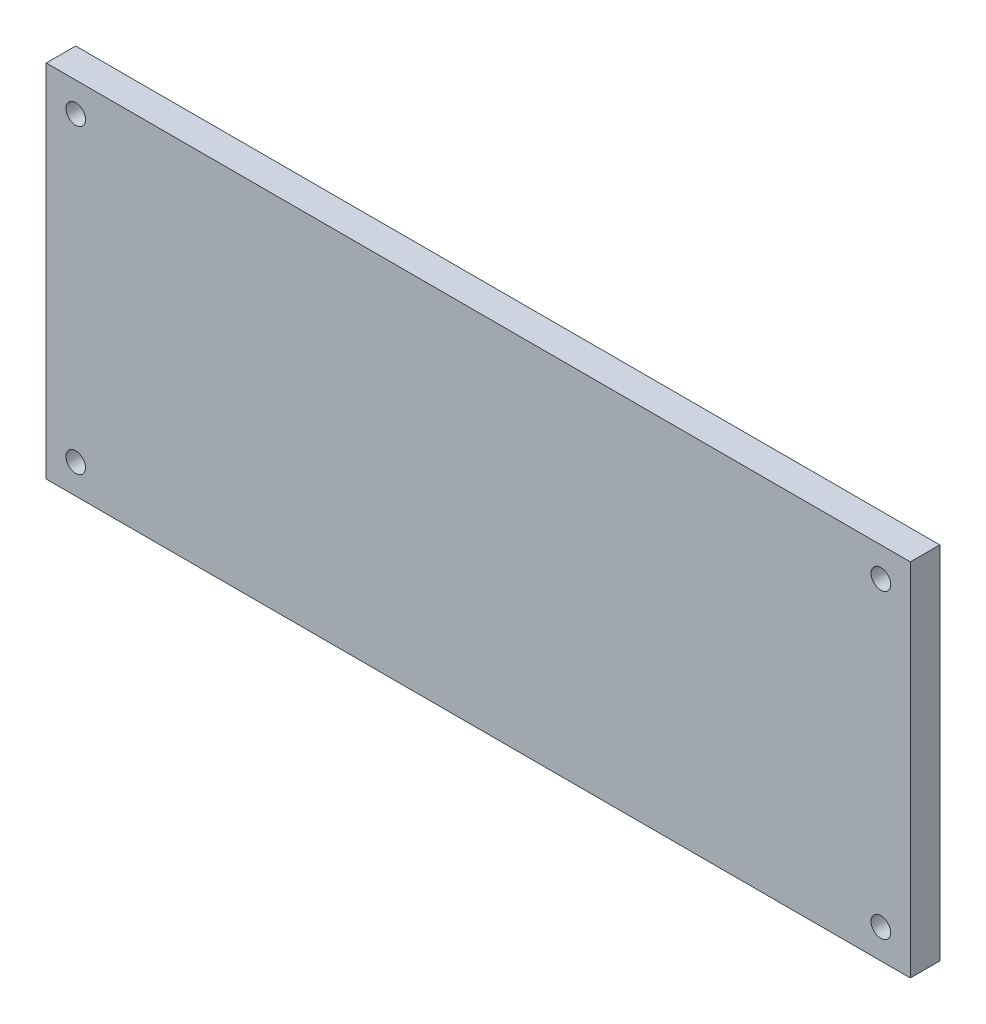
ISO-10303-21;
HEADER;
FILE_DESCRIPTION(('STEP AP214'),'2;1');
FILE_NAME('part.step','',(''),(''),'','','');
FILE_SCHEMA(('AUTOMOTIVE_DESIGN { 1 0 10303 214 1 1 1 1 }'));
ENDSEC;
DATA;
#1=APPLICATION_CONTEXT('core data for automotive mechanical design processes');
#2=APPLICATION_PROTOCOL_DEFINITION('international standard','automotive_design',2000,#1);
#3=PRODUCT_CONTEXT('',#1,'mechanical');
#4=PRODUCT('Part','Part','',(#3));
#5=PRODUCT_RELATED_PRODUCT_CATEGORY('part','',(#4));
#6=PRODUCT_DEFINITION_FORMATION('','',#4);
#7=PRODUCT_DEFINITION_CONTEXT('part definition',#1,'design');
#8=PRODUCT_DEFINITION('design','',#6,#7);
#9=PRODUCT_DEFINITION_SHAPE('','',#8);
#10=(LENGTH_UNIT() NAMED_UNIT(*) SI_UNIT(.MILLI.,.METRE.));
#11=(NAMED_UNIT(*) PLANE_ANGLE_UNIT() SI_UNIT($,.RADIAN.));
#12=(NAMED_UNIT(*) SI_UNIT($,.STERADIAN.) SOLID_ANGLE_UNIT());
#13=UNCERTAINTY_MEASURE_WITH_UNIT(LENGTH_MEASURE(1.E-05),#10,'distance_accuracy_value','');
#14=(GEOMETRIC_REPRESENTATION_CONTEXT(3) GLOBAL_UNCERTAINTY_ASSIGNED_CONTEXT((#13)) GLOBAL_UNIT_ASSIGNED_CONTEXT((#10,
#11,#12)) REPRESENTATION_CONTEXT('',''));
#15=CARTESIAN_POINT('',(0.,0.,0.));
#16=DIRECTION('',(0.,0.,1.));
#17=DIRECTION('',(1.,0.,0.));
#18=AXIS2_PLACEMENT_3D('',#15,#16,#17);
#19=CARTESIAN_POINT('',(0.,0.,1.5));
#20=DIRECTION('',(0.,0.,-1.));
#21=DIRECTION('',(-1.,0.,0.));
#22=AXIS2_PLACEMENT_3D('',#19,#20,#21);
#23=PLANE('',#22);
#24=DIRECTION('',(0.,-1.,0.));
#25=VECTOR('',#24,1.);
#26=CARTESIAN_POINT('',(0.,0.,1.5));
#27=LINE('',#26,#25);
#28=CARTESIAN_POINT('',(0.,18.35,1.5));
#29=VERTEX_POINT('',#28);
#30=CARTESIAN_POINT('',(0.,0.,1.5));
#31=VERTEX_POINT('',#30);
#32=EDGE_CURVE('E98',#29,#31,#27,.T.);
#33=ORIENTED_EDGE('',*,*,#32,.T.);
#34=DIRECTION('',(1.,0.,0.));
#35=VECTOR('',#34,1.);
#36=CARTESIAN_POINT('',(0.,0.,1.5));
#37=LINE('',#36,#35);
#38=CARTESIAN_POINT('',(44.,0.,1.5));
#39=VERTEX_POINT('',#38);
#40=EDGE_CURVE('E93',#31,#39,#37,.T.);
#41=ORIENTED_EDGE('',*,*,#40,.T.);
#42=DIRECTION('',(0.,1.,0.));
#43=VECTOR('',#42,1.);
#44=CARTESIAN_POINT('',(44.,0.,1.5));
#45=LINE('',#44,#43);
#46=CARTESIAN_POINT('',(44.,18.35,1.5));
#47=VERTEX_POINT('',#46);
#48=EDGE_CURVE('E96',#39,#47,#45,.T.);
#49=ORIENTED_EDGE('',*,*,#48,.T.);
#50=DIRECTION('',(-1.,0.,0.));
#51=VECTOR('',#50,1.);
#52=CARTESIAN_POINT('',(0.,18.35,1.5));
#53=LINE('',#52,#51);
#54=EDGE_CURVE('E63',#47,#29,#53,.T.);
#55=ORIENTED_EDGE('',*,*,#54,.T.);
#56=EDGE_LOOP('',(#33,#41,#49,#55));
#57=FACE_BOUND('',#56,.T.);
#58=CARTESIAN_POINT('',(1.5,16.85,1.5));
#59=DIRECTION('',(0.,0.,1.));
#60=DIRECTION('',(1.,0.,0.));
#61=AXIS2_PLACEMENT_3D('',#58,#59,#60);
#62=CIRCLE('',#61,0.5);
#63=CARTESIAN_POINT('',(2.,16.85,1.5));
#64=VERTEX_POINT('',#63);
#65=EDGE_CURVE('E118',#64,#64,#62,.T.);
#66=ORIENTED_EDGE('',*,*,#65,.F.);
#67=EDGE_LOOP('',(#66));
#68=FACE_BOUND('',#67,.T.);
#69=CARTESIAN_POINT('',(42.5,16.85,1.5));
#70=DIRECTION('',(0.,0.,1.));
#71=DIRECTION('',(-1.,0.,0.));
#72=AXIS2_PLACEMENT_3D('',#69,#70,#71);
#73=CIRCLE('',#72,0.499999999999999);
#74=CARTESIAN_POINT('',(42.,16.85,1.5));
#75=VERTEX_POINT('',#74);
#76=EDGE_CURVE('E140',#75,#75,#73,.T.);
#77=ORIENTED_EDGE('',*,*,#76,.F.);
#78=EDGE_LOOP('',(#77));
#79=FACE_BOUND('',#78,.T.);
#80=CARTESIAN_POINT('',(42.5,1.5,1.5));
#81=DIRECTION('',(0.,0.,1.));
#82=DIRECTION('',(1.,0.,0.));
#83=AXIS2_PLACEMENT_3D('',#80,#81,#82);
#84=CIRCLE('',#83,0.499999999999999);
#85=CARTESIAN_POINT('',(43.,1.5,1.5));
#86=VERTEX_POINT('',#85);
#87=EDGE_CURVE('E148',#86,#86,#84,.T.);
#88=ORIENTED_EDGE('',*,*,#87,.F.);
#89=EDGE_LOOP('',(#88));
#90=FACE_BOUND('',#89,.T.);
#91=CARTESIAN_POINT('',(1.5,1.5,1.5));
#92=DIRECTION('',(0.,0.,1.));
#93=DIRECTION('',(-1.,0.,0.));
#94=AXIS2_PLACEMENT_3D('',#91,#92,#93);
#95=CIRCLE('',#94,0.5);
#96=CARTESIAN_POINT('',(1.,1.5,1.5));
#97=VERTEX_POINT('',#96);
#98=EDGE_CURVE('E156',#97,#97,#95,.T.);
#99=ORIENTED_EDGE('',*,*,#98,.F.);
#100=EDGE_LOOP('',(#99));
#101=FACE_BOUND('',#100,.T.);
#102=ADVANCED_FACE('F45',(#57,#68,#79,#90,#101),#23,.F.);
#103=CARTESIAN_POINT('',(0.,0.,0.));
#104=DIRECTION('',(0.,0.,-1.));
#105=DIRECTION('',(-1.,0.,0.));
#106=AXIS2_PLACEMENT_3D('',#103,#104,#105);
#107=PLANE('',#106);
#108=CARTESIAN_POINT('',(42.5,1.5,0.));
#109=DIRECTION('',(0.,0.,1.));
#110=DIRECTION('',(1.,0.,0.));
#111=AXIS2_PLACEMENT_3D('',#108,#109,#110);
#112=CIRCLE('',#111,0.499999999999999);
#113=CARTESIAN_POINT('',(43.,1.5,0.));
#114=VERTEX_POINT('',#113);
#115=EDGE_CURVE('E152',#114,#114,#112,.T.);
#116=ORIENTED_EDGE('',*,*,#115,.T.);
#117=EDGE_LOOP('',(#116));
#118=FACE_BOUND('',#117,.T.);
#119=CARTESIAN_POINT('',(1.5,16.85,0.));
#120=DIRECTION('',(0.,0.,1.));
#121=DIRECTION('',(1.,0.,0.));
#122=AXIS2_PLACEMENT_3D('',#119,#120,#121);
#123=CIRCLE('',#122,0.5);
#124=CARTESIAN_POINT('',(2.,16.85,0.));
#125=VERTEX_POINT('',#124);
#126=EDGE_CURVE('E136',#125,#125,#123,.T.);
#127=ORIENTED_EDGE('',*,*,#126,.T.);
#128=EDGE_LOOP('',(#127));
#129=FACE_BOUND('',#128,.T.);
#130=DIRECTION('',(0.,-1.,0.));
#131=VECTOR('',#130,1.);
#132=CARTESIAN_POINT('',(0.,0.,0.));
#133=LINE('',#132,#131);
#134=CARTESIAN_POINT('',(0.,18.35,0.));
#135=VERTEX_POINT('',#134);
#136=CARTESIAN_POINT('',(0.,0.,0.));
#137=VERTEX_POINT('',#136);
#138=EDGE_CURVE('E114',#135,#137,#133,.T.);
#139=ORIENTED_EDGE('',*,*,#138,.F.);
#140=DIRECTION('',(-1.,0.,0.));
#141=VECTOR('',#140,1.);
#142=CARTESIAN_POINT('',(0.,18.35,0.));
#143=LINE('',#142,#141);
#144=CARTESIAN_POINT('',(44.,18.35,0.));
#145=VERTEX_POINT('',#144);
#146=EDGE_CURVE('E86',#145,#135,#143,.T.);
#147=ORIENTED_EDGE('',*,*,#146,.F.);
#148=DIRECTION('',(0.,1.,0.));
#149=VECTOR('',#148,1.);
#150=CARTESIAN_POINT('',(44.,0.,0.));
#151=LINE('',#150,#149);
#152=CARTESIAN_POINT('',(44.,0.,0.));
#153=VERTEX_POINT('',#152);
#154=EDGE_CURVE('E80',#153,#145,#151,.T.);
#155=ORIENTED_EDGE('',*,*,#154,.F.);
#156=DIRECTION('',(1.,0.,0.));
#157=VECTOR('',#156,1.);
#158=CARTESIAN_POINT('',(0.,0.,0.));
#159=LINE('',#158,#157);
#160=EDGE_CURVE('E103',#137,#153,#159,.T.);
#161=ORIENTED_EDGE('',*,*,#160,.F.);
#162=EDGE_LOOP('',(#139,#147,#155,#161));
#163=FACE_BOUND('',#162,.T.);
#164=CARTESIAN_POINT('',(42.5,16.85,0.));
#165=DIRECTION('',(0.,0.,1.));
#166=DIRECTION('',(-1.,0.,0.));
#167=AXIS2_PLACEMENT_3D('',#164,#165,#166);
#168=CIRCLE('',#167,0.499999999999999);
#169=CARTESIAN_POINT('',(42.,16.85,0.));
#170=VERTEX_POINT('',#169);
#171=EDGE_CURVE('E144',#170,#170,#168,.T.);
#172=ORIENTED_EDGE('',*,*,#171,.T.);
#173=EDGE_LOOP('',(#172));
#174=FACE_BOUND('',#173,.T.);
#175=CARTESIAN_POINT('',(1.5,1.5,0.));
#176=DIRECTION('',(0.,0.,1.));
#177=DIRECTION('',(-1.,0.,0.));
#178=AXIS2_PLACEMENT_3D('',#175,#176,#177);
#179=CIRCLE('',#178,0.5);
#180=CARTESIAN_POINT('',(1.,1.5,0.));
#181=VERTEX_POINT('',#180);
#182=EDGE_CURVE('E160',#181,#181,#179,.T.);
#183=ORIENTED_EDGE('',*,*,#182,.T.);
#184=EDGE_LOOP('',(#183));
#185=FACE_BOUND('',#184,.T.);
#186=ADVANCED_FACE('F131',(#118,#129,#163,#174,#185),#107,.T.);
#187=CARTESIAN_POINT('',(0.,0.,1.5));
#188=DIRECTION('',(1.,0.,0.));
#189=DIRECTION('',(0.,0.,-1.));
#190=AXIS2_PLACEMENT_3D('',#187,#188,#189);
#191=PLANE('',#190);
#192=ORIENTED_EDGE('',*,*,#138,.T.);
#193=DIRECTION('',(0.,0.,-1.));
#194=VECTOR('',#193,1.);
#195=CARTESIAN_POINT('',(0.,0.,1.5));
#196=LINE('',#195,#194);
#197=EDGE_CURVE('E11',#31,#137,#196,.T.);
#198=ORIENTED_EDGE('',*,*,#197,.F.);
#199=ORIENTED_EDGE('',*,*,#32,.F.);
#200=DIRECTION('',(0.,0.,-1.));
#201=VECTOR('',#200,1.);
#202=CARTESIAN_POINT('',(0.,18.35,1.5));
#203=LINE('',#202,#201);
#204=EDGE_CURVE('E110',#29,#135,#203,.T.);
#205=ORIENTED_EDGE('',*,*,#204,.T.);
#206=EDGE_LOOP('',(#192,#198,#199,#205));
#207=FACE_BOUND('',#206,.T.);
#208=ADVANCED_FACE('F47',(#207),#191,.F.);
#209=CARTESIAN_POINT('',(0.,0.,1.5));
#210=DIRECTION('',(0.,1.,0.));
#211=DIRECTION('',(0.,0.,1.));
#212=AXIS2_PLACEMENT_3D('',#209,#210,#211);
#213=PLANE('',#212);
#214=ORIENTED_EDGE('',*,*,#160,.T.);
#215=DIRECTION('',(0.,0.,-1.));
#216=VECTOR('',#215,1.);
#217=CARTESIAN_POINT('',(44.,0.,1.5));
#218=LINE('',#217,#216);
#219=EDGE_CURVE('E55',#39,#153,#218,.T.);
#220=ORIENTED_EDGE('',*,*,#219,.F.);
#221=ORIENTED_EDGE('',*,*,#40,.F.);
#222=ORIENTED_EDGE('',*,*,#197,.T.);
#223=EDGE_LOOP('',(#214,#220,#221,#222));
#224=FACE_BOUND('',#223,.T.);
#225=ADVANCED_FACE('F102',(#224),#213,.F.);
#226=CARTESIAN_POINT('',(44.,0.,1.5));
#227=DIRECTION('',(-1.,0.,0.));
#228=DIRECTION('',(0.,0.,1.));
#229=AXIS2_PLACEMENT_3D('',#226,#227,#228);
#230=PLANE('',#229);
#231=ORIENTED_EDGE('',*,*,#154,.T.);
#232=DIRECTION('',(0.,0.,-1.));
#233=VECTOR('',#232,1.);
#234=CARTESIAN_POINT('',(44.,18.35,1.5));
#235=LINE('',#234,#233);
#236=EDGE_CURVE('E105',#47,#145,#235,.T.);
#237=ORIENTED_EDGE('',*,*,#236,.F.);
#238=ORIENTED_EDGE('',*,*,#48,.F.);
#239=ORIENTED_EDGE('',*,*,#219,.T.);
#240=EDGE_LOOP('',(#231,#237,#238,#239));
#241=FACE_BOUND('',#240,.T.);
#242=ADVANCED_FACE('F106',(#241),#230,.F.);
#243=CARTESIAN_POINT('',(0.,18.35,1.5));
#244=DIRECTION('',(0.,-1.,0.));
#245=DIRECTION('',(0.,0.,-1.));
#246=AXIS2_PLACEMENT_3D('',#243,#244,#245);
#247=PLANE('',#246);
#248=ORIENTED_EDGE('',*,*,#146,.T.);
#249=ORIENTED_EDGE('',*,*,#204,.F.);
#250=ORIENTED_EDGE('',*,*,#54,.F.);
#251=ORIENTED_EDGE('',*,*,#236,.T.);
#252=EDGE_LOOP('',(#248,#249,#250,#251));
#253=FACE_BOUND('',#252,.T.);
#254=ADVANCED_FACE('F128',(#253),#247,.F.);
#255=CARTESIAN_POINT('',(1.5,16.85,1.5));
#256=DIRECTION('',(0.,0.,-1.));
#257=DIRECTION('',(-1.,0.,0.));
#258=AXIS2_PLACEMENT_3D('',#255,#256,#257);
#259=CYLINDRICAL_SURFACE('',#258,0.5);
#260=ORIENTED_EDGE('',*,*,#65,.T.);
#261=EDGE_LOOP('',(#260));
#262=FACE_BOUND('',#261,.T.);
#263=ORIENTED_EDGE('',*,*,#126,.F.);
#264=EDGE_LOOP('',(#263));
#265=FACE_BOUND('',#264,.T.);
#266=ADVANCED_FACE('F179',(#262,#265),#259,.F.);
#267=CARTESIAN_POINT('',(42.5,16.85,1.5));
#268=DIRECTION('',(0.,0.,-1.));
#269=DIRECTION('',(-1.,0.,0.));
#270=AXIS2_PLACEMENT_3D('',#267,#268,#269);
#271=CYLINDRICAL_SURFACE('',#270,0.499999999999999);
#272=ORIENTED_EDGE('',*,*,#76,.T.);
#273=EDGE_LOOP('',(#272));
#274=FACE_BOUND('',#273,.T.);
#275=ORIENTED_EDGE('',*,*,#171,.F.);
#276=EDGE_LOOP('',(#275));
#277=FACE_BOUND('',#276,.T.);
#278=ADVANCED_FACE('F233',(#274,#277),#271,.F.);
#279=CARTESIAN_POINT('',(42.5,1.5,1.5));
#280=DIRECTION('',(0.,0.,-1.));
#281=DIRECTION('',(-1.,0.,0.));
#282=AXIS2_PLACEMENT_3D('',#279,#280,#281);
#283=CYLINDRICAL_SURFACE('',#282,0.499999999999999);
#284=ORIENTED_EDGE('',*,*,#87,.T.);
#285=EDGE_LOOP('',(#284));
#286=FACE_BOUND('',#285,.T.);
#287=ORIENTED_EDGE('',*,*,#115,.F.);
#288=EDGE_LOOP('',(#287));
#289=FACE_BOUND('',#288,.T.);
#290=ADVANCED_FACE('F242',(#286,#289),#283,.F.);
#291=CARTESIAN_POINT('',(1.5,1.5,1.5));
#292=DIRECTION('',(0.,0.,-1.));
#293=DIRECTION('',(-1.,0.,0.));
#294=AXIS2_PLACEMENT_3D('',#291,#292,#293);
#295=CYLINDRICAL_SURFACE('',#294,0.5);
#296=ORIENTED_EDGE('',*,*,#98,.T.);
#297=EDGE_LOOP('',(#296));
#298=FACE_BOUND('',#297,.T.);
#299=ORIENTED_EDGE('',*,*,#182,.F.);
#300=EDGE_LOOP('',(#299));
#301=FACE_BOUND('',#300,.T.);
#302=ADVANCED_FACE('F168',(#298,#301),#295,.F.);
#303=CLOSED_SHELL('',(#102,#186,#208,#225,#242,#254,#266,#278,#290,#302));
#304=MANIFOLD_SOLID_BREP('B2',#303);
#305=ADVANCED_BREP_SHAPE_REPRESENTATION('',(#18,#304),#14);
#306=SHAPE_DEFINITION_REPRESENTATION(#9,#305);
ENDSEC;
END-ISO-10303-21;
